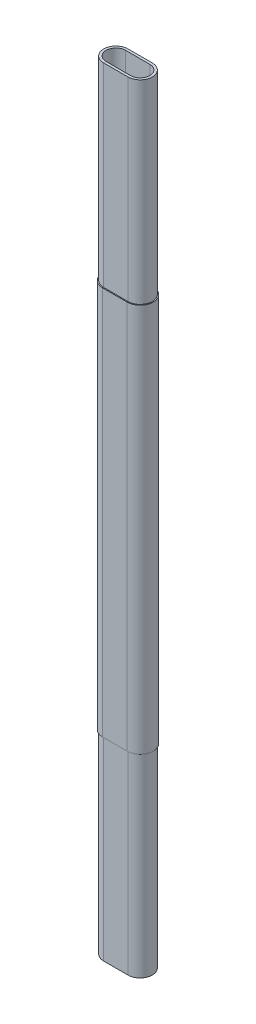
ISO-10303-21;
HEADER;
FILE_DESCRIPTION(('STEP AP214'),'2;1');
FILE_NAME('part.step','',(''),(''),'','','');
FILE_SCHEMA(('AUTOMOTIVE_DESIGN { 1 0 10303 214 1 1 1 1 }'));
ENDSEC;
DATA;
#1=APPLICATION_CONTEXT('core data for automotive mechanical design processes');
#2=APPLICATION_PROTOCOL_DEFINITION('international standard','automotive_design',2000,#1);
#3=PRODUCT_CONTEXT('',#1,'mechanical');
#4=PRODUCT('Part','Part','',(#3));
#5=PRODUCT_RELATED_PRODUCT_CATEGORY('part','',(#4));
#6=PRODUCT_DEFINITION_FORMATION('','',#4);
#7=PRODUCT_DEFINITION_CONTEXT('part definition',#1,'design');
#8=PRODUCT_DEFINITION('design','',#6,#7);
#9=PRODUCT_DEFINITION_SHAPE('','',#8);
#10=(LENGTH_UNIT() NAMED_UNIT(*) SI_UNIT(.MILLI.,.METRE.));
#11=(NAMED_UNIT(*) PLANE_ANGLE_UNIT() SI_UNIT($,.RADIAN.));
#12=(NAMED_UNIT(*) SI_UNIT($,.STERADIAN.) SOLID_ANGLE_UNIT());
#13=UNCERTAINTY_MEASURE_WITH_UNIT(LENGTH_MEASURE(1.E-05),#10,'distance_accuracy_value','');
#14=(GEOMETRIC_REPRESENTATION_CONTEXT(3) GLOBAL_UNCERTAINTY_ASSIGNED_CONTEXT((#13)) GLOBAL_UNIT_ASSIGNED_CONTEXT((#10,
#11,#12)) REPRESENTATION_CONTEXT('',''));
#15=CARTESIAN_POINT('',(0.,0.,0.));
#16=DIRECTION('',(0.,0.,1.));
#17=DIRECTION('',(1.,0.,0.));
#18=AXIS2_PLACEMENT_3D('',#15,#16,#17);
#19=CARTESIAN_POINT('',(-0.25,-8.,0.));
#20=DIRECTION('',(0.,1.,0.));
#21=DIRECTION('',(0.,0.,1.));
#22=AXIS2_PLACEMENT_3D('',#19,#20,#21);
#23=CYLINDRICAL_SURFACE('',#22,0.25);
#24=DIRECTION('',(0.,1.,0.));
#25=VECTOR('',#24,1.);
#26=CARTESIAN_POINT('',(-0.25,-8.,0.25));
#27=LINE('',#26,#25);
#28=CARTESIAN_POINT('',(-0.25,-8.,0.25));
#29=VERTEX_POINT('',#28);
#30=CARTESIAN_POINT('',(-0.25,-4.,0.25));
#31=VERTEX_POINT('',#30);
#32=EDGE_CURVE('E134',#29,#31,#27,.T.);
#33=ORIENTED_EDGE('',*,*,#32,.T.);
#34=CARTESIAN_POINT('',(-0.25,-4.,0.));
#35=DIRECTION('',(0.,1.,0.));
#36=DIRECTION('',(0.,0.,1.));
#37=AXIS2_PLACEMENT_3D('',#34,#35,#36);
#38=CIRCLE('',#37,0.25);
#39=CARTESIAN_POINT('',(-0.25,-4.,-0.25));
#40=VERTEX_POINT('',#39);
#41=EDGE_CURVE('E277',#40,#31,#38,.T.);
#42=ORIENTED_EDGE('',*,*,#41,.F.);
#43=DIRECTION('',(0.,1.,0.));
#44=VECTOR('',#43,1.);
#45=CARTESIAN_POINT('',(-0.25,-8.,-0.25));
#46=LINE('',#45,#44);
#47=CARTESIAN_POINT('',(-0.25,-8.,-0.25));
#48=VERTEX_POINT('',#47);
#49=EDGE_CURVE('E12',#48,#40,#46,.T.);
#50=ORIENTED_EDGE('',*,*,#49,.F.);
#51=CARTESIAN_POINT('',(-0.25,-8.,0.));
#52=DIRECTION('',(0.,1.,0.));
#53=DIRECTION('',(0.,0.,1.));
#54=AXIS2_PLACEMENT_3D('',#51,#52,#53);
#55=CIRCLE('',#54,0.25);
#56=EDGE_CURVE('E341',#48,#29,#55,.T.);
#57=ORIENTED_EDGE('',*,*,#56,.T.);
#58=EDGE_LOOP('',(#33,#42,#50,#57));
#59=FACE_BOUND('',#58,.T.);
#60=ADVANCED_FACE('F130',(#59),#23,.T.);
#61=CARTESIAN_POINT('',(-0.25,-8.,-0.25));
#62=DIRECTION('',(0.,0.,-1.));
#63=DIRECTION('',(-1.,0.,0.));
#64=AXIS2_PLACEMENT_3D('',#61,#62,#63);
#65=PLANE('',#64);
#66=ORIENTED_EDGE('',*,*,#49,.T.);
#67=DIRECTION('',(-1.,0.,0.));
#68=VECTOR('',#67,1.);
#69=CARTESIAN_POINT('',(-0.25,-4.,-0.25));
#70=LINE('',#69,#68);
#71=CARTESIAN_POINT('',(0.25,-4.,-0.25));
#72=VERTEX_POINT('',#71);
#73=EDGE_CURVE('E283',#72,#40,#70,.T.);
#74=ORIENTED_EDGE('',*,*,#73,.F.);
#75=DIRECTION('',(0.,1.,0.));
#76=VECTOR('',#75,1.);
#77=CARTESIAN_POINT('',(0.25,-8.,-0.25));
#78=LINE('',#77,#76);
#79=CARTESIAN_POINT('',(0.25,-8.,-0.25));
#80=VERTEX_POINT('',#79);
#81=EDGE_CURVE('E357',#80,#72,#78,.T.);
#82=ORIENTED_EDGE('',*,*,#81,.F.);
#83=DIRECTION('',(-1.,0.,0.));
#84=VECTOR('',#83,1.);
#85=CARTESIAN_POINT('',(-0.25,-8.,-0.25));
#86=LINE('',#85,#84);
#87=EDGE_CURVE('E255',#80,#48,#86,.T.);
#88=ORIENTED_EDGE('',*,*,#87,.T.);
#89=EDGE_LOOP('',(#66,#74,#82,#88));
#90=FACE_BOUND('',#89,.T.);
#91=ADVANCED_FACE('F383',(#90),#65,.T.);
#92=CARTESIAN_POINT('',(0.25,-8.,0.));
#93=DIRECTION('',(0.,1.,0.));
#94=DIRECTION('',(0.,0.,1.));
#95=AXIS2_PLACEMENT_3D('',#92,#93,#94);
#96=CYLINDRICAL_SURFACE('',#95,0.25);
#97=ORIENTED_EDGE('',*,*,#81,.T.);
#98=CARTESIAN_POINT('',(0.25,-4.,0.));
#99=DIRECTION('',(0.,1.,0.));
#100=DIRECTION('',(0.,0.,1.));
#101=AXIS2_PLACEMENT_3D('',#98,#99,#100);
#102=CIRCLE('',#101,0.25);
#103=CARTESIAN_POINT('',(0.25,-4.,0.25));
#104=VERTEX_POINT('',#103);
#105=EDGE_CURVE('E281',#104,#72,#102,.T.);
#106=ORIENTED_EDGE('',*,*,#105,.F.);
#107=DIRECTION('',(0.,1.,0.));
#108=VECTOR('',#107,1.);
#109=CARTESIAN_POINT('',(0.25,-8.,0.25));
#110=LINE('',#109,#108);
#111=CARTESIAN_POINT('',(0.25,-8.,0.25));
#112=VERTEX_POINT('',#111);
#113=EDGE_CURVE('E360',#112,#104,#110,.T.);
#114=ORIENTED_EDGE('',*,*,#113,.F.);
#115=CARTESIAN_POINT('',(0.25,-8.,0.));
#116=DIRECTION('',(0.,1.,0.));
#117=DIRECTION('',(0.,0.,1.));
#118=AXIS2_PLACEMENT_3D('',#115,#116,#117);
#119=CIRCLE('',#118,0.25);
#120=EDGE_CURVE('E352',#112,#80,#119,.T.);
#121=ORIENTED_EDGE('',*,*,#120,.T.);
#122=EDGE_LOOP('',(#97,#106,#114,#121));
#123=FACE_BOUND('',#122,.T.);
#124=ADVANCED_FACE('F376',(#123),#96,.T.);
#125=CARTESIAN_POINT('',(0.25,-8.,0.25));
#126=DIRECTION('',(0.,0.,1.));
#127=DIRECTION('',(1.,0.,0.));
#128=AXIS2_PLACEMENT_3D('',#125,#126,#127);
#129=PLANE('',#128);
#130=ORIENTED_EDGE('',*,*,#113,.T.);
#131=DIRECTION('',(1.,0.,0.));
#132=VECTOR('',#131,1.);
#133=CARTESIAN_POINT('',(-0.25,-4.,0.25));
#134=LINE('',#133,#132);
#135=EDGE_CURVE('E279',#31,#104,#134,.T.);
#136=ORIENTED_EDGE('',*,*,#135,.F.);
#137=ORIENTED_EDGE('',*,*,#32,.F.);
#138=DIRECTION('',(1.,0.,0.));
#139=VECTOR('',#138,1.);
#140=CARTESIAN_POINT('',(0.25,-8.,0.25));
#141=LINE('',#140,#139);
#142=EDGE_CURVE('E349',#29,#112,#141,.T.);
#143=ORIENTED_EDGE('',*,*,#142,.T.);
#144=EDGE_LOOP('',(#130,#136,#137,#143));
#145=FACE_BOUND('',#144,.T.);
#146=ADVANCED_FACE('F370',(#145),#129,.T.);
#147=CARTESIAN_POINT('',(-0.25,4.,0.));
#148=DIRECTION('',(0.,1.,0.));
#149=DIRECTION('',(0.,0.,1.));
#150=AXIS2_PLACEMENT_3D('',#147,#148,#149);
#151=CIRCLE('',#150,0.25);
#152=CARTESIAN_POINT('',(-0.25,4.,-0.25));
#153=VERTEX_POINT('',#152);
#154=CARTESIAN_POINT('',(-0.25,4.,0.25));
#155=VERTEX_POINT('',#154);
#156=EDGE_CURVE('E257',#153,#155,#151,.T.);
#157=ORIENTED_EDGE('',*,*,#156,.T.);
#158=CARTESIAN_POINT('',(-0.25,8.,0.25));
#159=VERTEX_POINT('',#158);
#160=EDGE_CURVE('E245',#155,#159,#27,.T.);
#161=ORIENTED_EDGE('',*,*,#160,.T.);
#162=CARTESIAN_POINT('',(-0.25,8.,0.));
#163=DIRECTION('',(0.,1.,0.));
#164=DIRECTION('',(0.,0.,1.));
#165=AXIS2_PLACEMENT_3D('',#162,#163,#164);
#166=CIRCLE('',#165,0.25);
#167=CARTESIAN_POINT('',(-0.25,8.,-0.25));
#168=VERTEX_POINT('',#167);
#169=EDGE_CURVE('E317',#168,#159,#166,.T.);
#170=ORIENTED_EDGE('',*,*,#169,.F.);
#171=EDGE_CURVE('E139',#153,#168,#46,.T.);
#172=ORIENTED_EDGE('',*,*,#171,.F.);
#173=EDGE_LOOP('',(#157,#161,#170,#172));
#174=FACE_BOUND('',#173,.T.);
#175=ADVANCED_FACE('F132',(#174),#23,.T.);
#176=DIRECTION('',(-1.,0.,0.));
#177=VECTOR('',#176,1.);
#178=CARTESIAN_POINT('',(-0.25,4.,-0.25));
#179=LINE('',#178,#177);
#180=CARTESIAN_POINT('',(0.25,4.,-0.25));
#181=VERTEX_POINT('',#180);
#182=EDGE_CURVE('E147',#181,#153,#179,.T.);
#183=ORIENTED_EDGE('',*,*,#182,.T.);
#184=ORIENTED_EDGE('',*,*,#171,.T.);
#185=DIRECTION('',(-1.,0.,0.));
#186=VECTOR('',#185,1.);
#187=CARTESIAN_POINT('',(-0.25,8.,-0.25));
#188=LINE('',#187,#186);
#189=CARTESIAN_POINT('',(0.25,8.,-0.25));
#190=VERTEX_POINT('',#189);
#191=EDGE_CURVE('E323',#190,#168,#188,.T.);
#192=ORIENTED_EDGE('',*,*,#191,.F.);
#193=EDGE_CURVE('E359',#181,#190,#78,.T.);
#194=ORIENTED_EDGE('',*,*,#193,.F.);
#195=EDGE_LOOP('',(#183,#184,#192,#194));
#196=FACE_BOUND('',#195,.T.);
#197=ADVANCED_FACE('F386',(#196),#65,.T.);
#198=CARTESIAN_POINT('',(0.25,4.,0.));
#199=DIRECTION('',(0.,1.,0.));
#200=DIRECTION('',(0.,0.,1.));
#201=AXIS2_PLACEMENT_3D('',#198,#199,#200);
#202=CIRCLE('',#201,0.25);
#203=CARTESIAN_POINT('',(0.25,4.,0.25));
#204=VERTEX_POINT('',#203);
#205=EDGE_CURVE('E155',#204,#181,#202,.T.);
#206=ORIENTED_EDGE('',*,*,#205,.T.);
#207=ORIENTED_EDGE('',*,*,#193,.T.);
#208=CARTESIAN_POINT('',(0.25,8.,0.));
#209=DIRECTION('',(0.,1.,0.));
#210=DIRECTION('',(0.,0.,1.));
#211=AXIS2_PLACEMENT_3D('',#208,#209,#210);
#212=CIRCLE('',#211,0.25);
#213=CARTESIAN_POINT('',(0.25,8.,0.25));
#214=VERTEX_POINT('',#213);
#215=EDGE_CURVE('E320',#214,#190,#212,.T.);
#216=ORIENTED_EDGE('',*,*,#215,.F.);
#217=EDGE_CURVE('E362',#204,#214,#110,.T.);
#218=ORIENTED_EDGE('',*,*,#217,.F.);
#219=EDGE_LOOP('',(#206,#207,#216,#218));
#220=FACE_BOUND('',#219,.T.);
#221=ADVANCED_FACE('F392',(#220),#96,.T.);
#222=DIRECTION('',(1.,0.,0.));
#223=VECTOR('',#222,1.);
#224=CARTESIAN_POINT('',(-0.25,4.,0.25));
#225=LINE('',#224,#223);
#226=EDGE_CURVE('E249',#155,#204,#225,.T.);
#227=ORIENTED_EDGE('',*,*,#226,.T.);
#228=ORIENTED_EDGE('',*,*,#217,.T.);
#229=DIRECTION('',(1.,0.,0.));
#230=VECTOR('',#229,1.);
#231=CARTESIAN_POINT('',(0.25,8.,0.25));
#232=LINE('',#231,#230);
#233=EDGE_CURVE('E251',#159,#214,#232,.T.);
#234=ORIENTED_EDGE('',*,*,#233,.F.);
#235=ORIENTED_EDGE('',*,*,#160,.F.);
#236=EDGE_LOOP('',(#227,#228,#234,#235));
#237=FACE_BOUND('',#236,.T.);
#238=ADVANCED_FACE('F247',(#237),#129,.T.);
#239=CARTESIAN_POINT('',(-0.25,-8.,0.));
#240=DIRECTION('',(0.,1.,0.));
#241=DIRECTION('',(0.,0.,1.));
#242=AXIS2_PLACEMENT_3D('',#239,#240,#241);
#243=PLANE('',#242);
#244=DIRECTION('',(-1.,0.,0.));
#245=VECTOR('',#244,1.);
#246=CARTESIAN_POINT('',(-0.25,-8.,-0.2));
#247=LINE('',#246,#245);
#248=CARTESIAN_POINT('',(0.25,-8.,-0.2));
#249=VERTEX_POINT('',#248);
#250=CARTESIAN_POINT('',(-0.25,-8.,-0.2));
#251=VERTEX_POINT('',#250);
#252=EDGE_CURVE('E335',#249,#251,#247,.T.);
#253=ORIENTED_EDGE('',*,*,#252,.T.);
#254=CARTESIAN_POINT('',(-0.25,-8.,0.));
#255=DIRECTION('',(0.,1.,0.));
#256=DIRECTION('',(1.,0.,0.));
#257=AXIS2_PLACEMENT_3D('',#254,#255,#256);
#258=CIRCLE('',#257,0.2);
#259=CARTESIAN_POINT('',(-0.25,-8.,0.2));
#260=VERTEX_POINT('',#259);
#261=EDGE_CURVE('E326',#251,#260,#258,.T.);
#262=ORIENTED_EDGE('',*,*,#261,.T.);
#263=DIRECTION('',(1.,0.,0.));
#264=VECTOR('',#263,1.);
#265=CARTESIAN_POINT('',(0.25,-8.,0.2));
#266=LINE('',#265,#264);
#267=CARTESIAN_POINT('',(0.25,-8.,0.2));
#268=VERTEX_POINT('',#267);
#269=EDGE_CURVE('E329',#260,#268,#266,.T.);
#270=ORIENTED_EDGE('',*,*,#269,.T.);
#271=CARTESIAN_POINT('',(0.25,-8.,0.));
#272=DIRECTION('',(0.,1.,0.));
#273=DIRECTION('',(1.,0.,0.));
#274=AXIS2_PLACEMENT_3D('',#271,#272,#273);
#275=CIRCLE('',#274,0.2);
#276=EDGE_CURVE('E332',#268,#249,#275,.T.);
#277=ORIENTED_EDGE('',*,*,#276,.T.);
#278=EDGE_LOOP('',(#253,#262,#270,#277));
#279=FACE_BOUND('',#278,.T.);
#280=ORIENTED_EDGE('',*,*,#56,.F.);
#281=ORIENTED_EDGE('',*,*,#87,.F.);
#282=ORIENTED_EDGE('',*,*,#120,.F.);
#283=ORIENTED_EDGE('',*,*,#142,.F.);
#284=EDGE_LOOP('',(#280,#281,#282,#283));
#285=FACE_BOUND('',#284,.T.);
#286=ADVANCED_FACE('F373',(#279,#285),#243,.F.);
#287=CARTESIAN_POINT('',(-0.25,-8.,0.));
#288=DIRECTION('',(0.,1.,0.));
#289=DIRECTION('',(0.,0.,1.));
#290=AXIS2_PLACEMENT_3D('',#287,#288,#289);
#291=CYLINDRICAL_SURFACE('',#290,0.2);
#292=DIRECTION('',(0.,1.,0.));
#293=VECTOR('',#292,1.);
#294=CARTESIAN_POINT('',(-0.25,-8.,-0.2));
#295=LINE('',#294,#293);
#296=CARTESIAN_POINT('',(-0.25,8.,-0.2));
#297=VERTEX_POINT('',#296);
#298=EDGE_CURVE('E339',#251,#297,#295,.T.);
#299=ORIENTED_EDGE('',*,*,#298,.T.);
#300=CARTESIAN_POINT('',(-0.25,8.,0.));
#301=DIRECTION('',(0.,1.,0.));
#302=DIRECTION('',(1.,0.,0.));
#303=AXIS2_PLACEMENT_3D('',#300,#301,#302);
#304=CIRCLE('',#303,0.2);
#305=CARTESIAN_POINT('',(-0.25,8.,0.2));
#306=VERTEX_POINT('',#305);
#307=EDGE_CURVE('E300',#297,#306,#304,.T.);
#308=ORIENTED_EDGE('',*,*,#307,.T.);
#309=DIRECTION('',(0.,1.,0.));
#310=VECTOR('',#309,1.);
#311=CARTESIAN_POINT('',(-0.25,-8.,0.2));
#312=LINE('',#311,#310);
#313=EDGE_CURVE('E338',#260,#306,#312,.T.);
#314=ORIENTED_EDGE('',*,*,#313,.F.);
#315=ORIENTED_EDGE('',*,*,#261,.F.);
#316=EDGE_LOOP('',(#299,#308,#314,#315));
#317=FACE_BOUND('',#316,.T.);
#318=ADVANCED_FACE('F408',(#317),#291,.F.);
#319=CARTESIAN_POINT('',(-0.25,-8.,-0.2));
#320=DIRECTION('',(0.,0.,-1.));
#321=DIRECTION('',(-1.,0.,0.));
#322=AXIS2_PLACEMENT_3D('',#319,#320,#321);
#323=PLANE('',#322);
#324=DIRECTION('',(0.,1.,0.));
#325=VECTOR('',#324,1.);
#326=CARTESIAN_POINT('',(0.25,-8.,-0.2));
#327=LINE('',#326,#325);
#328=CARTESIAN_POINT('',(0.25,8.,-0.2));
#329=VERTEX_POINT('',#328);
#330=EDGE_CURVE('E342',#249,#329,#327,.T.);
#331=ORIENTED_EDGE('',*,*,#330,.T.);
#332=DIRECTION('',(-1.,0.,0.));
#333=VECTOR('',#332,1.);
#334=CARTESIAN_POINT('',(-0.25,8.,-0.2));
#335=LINE('',#334,#333);
#336=EDGE_CURVE('E314',#329,#297,#335,.T.);
#337=ORIENTED_EDGE('',*,*,#336,.T.);
#338=ORIENTED_EDGE('',*,*,#298,.F.);
#339=ORIENTED_EDGE('',*,*,#252,.F.);
#340=EDGE_LOOP('',(#331,#337,#338,#339));
#341=FACE_BOUND('',#340,.T.);
#342=ADVANCED_FACE('F413',(#341),#323,.F.);
#343=CARTESIAN_POINT('',(0.25,-8.,0.));
#344=DIRECTION('',(0.,1.,0.));
#345=DIRECTION('',(0.,0.,1.));
#346=AXIS2_PLACEMENT_3D('',#343,#344,#345);
#347=CYLINDRICAL_SURFACE('',#346,0.2);
#348=DIRECTION('',(0.,1.,0.));
#349=VECTOR('',#348,1.);
#350=CARTESIAN_POINT('',(0.25,-8.,0.2));
#351=LINE('',#350,#349);
#352=CARTESIAN_POINT('',(0.25,8.,0.2));
#353=VERTEX_POINT('',#352);
#354=EDGE_CURVE('E344',#268,#353,#351,.T.);
#355=ORIENTED_EDGE('',*,*,#354,.T.);
#356=CARTESIAN_POINT('',(0.25,8.,0.));
#357=DIRECTION('',(0.,1.,0.));
#358=DIRECTION('',(1.,0.,0.));
#359=AXIS2_PLACEMENT_3D('',#356,#357,#358);
#360=CIRCLE('',#359,0.2);
#361=EDGE_CURVE('E311',#353,#329,#360,.T.);
#362=ORIENTED_EDGE('',*,*,#361,.T.);
#363=ORIENTED_EDGE('',*,*,#330,.F.);
#364=ORIENTED_EDGE('',*,*,#276,.F.);
#365=EDGE_LOOP('',(#355,#362,#363,#364));
#366=FACE_BOUND('',#365,.T.);
#367=ADVANCED_FACE('F421',(#366),#347,.F.);
#368=CARTESIAN_POINT('',(0.25,-8.,0.2));
#369=DIRECTION('',(0.,0.,1.));
#370=DIRECTION('',(1.,0.,0.));
#371=AXIS2_PLACEMENT_3D('',#368,#369,#370);
#372=PLANE('',#371);
#373=ORIENTED_EDGE('',*,*,#313,.T.);
#374=DIRECTION('',(1.,0.,0.));
#375=VECTOR('',#374,1.);
#376=CARTESIAN_POINT('',(0.25,8.,0.2));
#377=LINE('',#376,#375);
#378=EDGE_CURVE('E308',#306,#353,#377,.T.);
#379=ORIENTED_EDGE('',*,*,#378,.T.);
#380=ORIENTED_EDGE('',*,*,#354,.F.);
#381=ORIENTED_EDGE('',*,*,#269,.F.);
#382=EDGE_LOOP('',(#373,#379,#380,#381));
#383=FACE_BOUND('',#382,.T.);
#384=ADVANCED_FACE('F417',(#383),#372,.F.);
#385=CARTESIAN_POINT('',(-0.25,8.,0.));
#386=DIRECTION('',(0.,1.,0.));
#387=DIRECTION('',(0.,0.,1.));
#388=AXIS2_PLACEMENT_3D('',#385,#386,#387);
#389=PLANE('',#388);
#390=ORIENTED_EDGE('',*,*,#169,.T.);
#391=ORIENTED_EDGE('',*,*,#233,.T.);
#392=ORIENTED_EDGE('',*,*,#215,.T.);
#393=ORIENTED_EDGE('',*,*,#191,.T.);
#394=EDGE_LOOP('',(#390,#391,#392,#393));
#395=FACE_BOUND('',#394,.T.);
#396=ORIENTED_EDGE('',*,*,#378,.F.);
#397=ORIENTED_EDGE('',*,*,#307,.F.);
#398=ORIENTED_EDGE('',*,*,#336,.F.);
#399=ORIENTED_EDGE('',*,*,#361,.F.);
#400=EDGE_LOOP('',(#396,#397,#398,#399));
#401=FACE_BOUND('',#400,.T.);
#402=ADVANCED_FACE('F420',(#395,#401),#389,.T.);
#403=CARTESIAN_POINT('',(-0.25,-4.,0.));
#404=DIRECTION('',(0.,1.,0.));
#405=DIRECTION('',(0.,0.,1.));
#406=AXIS2_PLACEMENT_3D('',#403,#404,#405);
#407=CYLINDRICAL_SURFACE('',#406,0.27);
#408=DIRECTION('',(0.,1.,0.));
#409=VECTOR('',#408,1.);
#410=CARTESIAN_POINT('',(-0.25,-4.,0.27));
#411=LINE('',#410,#409);
#412=CARTESIAN_POINT('',(-0.25,-4.,0.27));
#413=VERTEX_POINT('',#412);
#414=CARTESIAN_POINT('',(-0.25,4.,0.27));
#415=VERTEX_POINT('',#414);
#416=EDGE_CURVE('E297',#413,#415,#411,.T.);
#417=ORIENTED_EDGE('',*,*,#416,.T.);
#418=CARTESIAN_POINT('',(-0.25,4.,0.));
#419=DIRECTION('',(0.,1.,0.));
#420=DIRECTION('',(-1.,0.,0.));
#421=AXIS2_PLACEMENT_3D('',#418,#419,#420);
#422=CIRCLE('',#421,0.27);
#423=CARTESIAN_POINT('',(-0.25,4.,-0.27));
#424=VERTEX_POINT('',#423);
#425=EDGE_CURVE('E265',#424,#415,#422,.T.);
#426=ORIENTED_EDGE('',*,*,#425,.F.);
#427=DIRECTION('',(0.,1.,0.));
#428=VECTOR('',#427,1.);
#429=CARTESIAN_POINT('',(-0.25,-4.,-0.27));
#430=LINE('',#429,#428);
#431=CARTESIAN_POINT('',(-0.25,-4.,-0.27));
#432=VERTEX_POINT('',#431);
#433=EDGE_CURVE('E298',#432,#424,#430,.T.);
#434=ORIENTED_EDGE('',*,*,#433,.F.);
#435=CARTESIAN_POINT('',(-0.25,-4.,0.));
#436=DIRECTION('',(0.,1.,0.));
#437=DIRECTION('',(-1.,0.,0.));
#438=AXIS2_PLACEMENT_3D('',#435,#436,#437);
#439=CIRCLE('',#438,0.27);
#440=EDGE_CURVE('E285',#432,#413,#439,.T.);
#441=ORIENTED_EDGE('',*,*,#440,.T.);
#442=EDGE_LOOP('',(#417,#426,#434,#441));
#443=FACE_BOUND('',#442,.T.);
#444=ADVANCED_FACE('F431',(#443),#407,.T.);
#445=CARTESIAN_POINT('',(-0.25,-4.,-0.27));
#446=DIRECTION('',(0.,0.,-1.));
#447=DIRECTION('',(-1.,0.,0.));
#448=AXIS2_PLACEMENT_3D('',#445,#446,#447);
#449=PLANE('',#448);
#450=ORIENTED_EDGE('',*,*,#433,.T.);
#451=DIRECTION('',(-1.,0.,0.));
#452=VECTOR('',#451,1.);
#453=CARTESIAN_POINT('',(-0.25,4.,-0.27));
#454=LINE('',#453,#452);
#455=CARTESIAN_POINT('',(0.25,4.,-0.27));
#456=VERTEX_POINT('',#455);
#457=EDGE_CURVE('E274',#456,#424,#454,.T.);
#458=ORIENTED_EDGE('',*,*,#457,.F.);
#459=DIRECTION('',(0.,1.,0.));
#460=VECTOR('',#459,1.);
#461=CARTESIAN_POINT('',(0.25,-4.,-0.27));
#462=LINE('',#461,#460);
#463=CARTESIAN_POINT('',(0.25,-4.,-0.27));
#464=VERTEX_POINT('',#463);
#465=EDGE_CURVE('E301',#464,#456,#462,.T.);
#466=ORIENTED_EDGE('',*,*,#465,.F.);
#467=DIRECTION('',(-1.,0.,0.));
#468=VECTOR('',#467,1.);
#469=CARTESIAN_POINT('',(-0.25,-4.,-0.27));
#470=LINE('',#469,#468);
#471=EDGE_CURVE('E294',#464,#432,#470,.T.);
#472=ORIENTED_EDGE('',*,*,#471,.T.);
#473=EDGE_LOOP('',(#450,#458,#466,#472));
#474=FACE_BOUND('',#473,.T.);
#475=ADVANCED_FACE('F435',(#474),#449,.T.);
#476=CARTESIAN_POINT('',(0.25,-4.,0.));
#477=DIRECTION('',(0.,1.,0.));
#478=DIRECTION('',(0.,0.,1.));
#479=AXIS2_PLACEMENT_3D('',#476,#477,#478);
#480=CYLINDRICAL_SURFACE('',#479,0.27);
#481=ORIENTED_EDGE('',*,*,#465,.T.);
#482=CARTESIAN_POINT('',(0.25,4.,0.));
#483=DIRECTION('',(0.,1.,0.));
#484=DIRECTION('',(-1.,0.,0.));
#485=AXIS2_PLACEMENT_3D('',#482,#483,#484);
#486=CIRCLE('',#485,0.27);
#487=CARTESIAN_POINT('',(0.25,4.,0.27));
#488=VERTEX_POINT('',#487);
#489=EDGE_CURVE('E271',#488,#456,#486,.T.);
#490=ORIENTED_EDGE('',*,*,#489,.F.);
#491=DIRECTION('',(0.,1.,0.));
#492=VECTOR('',#491,1.);
#493=CARTESIAN_POINT('',(0.25,-4.,0.27));
#494=LINE('',#493,#492);
#495=CARTESIAN_POINT('',(0.25,-4.,0.27));
#496=VERTEX_POINT('',#495);
#497=EDGE_CURVE('E303',#496,#488,#494,.T.);
#498=ORIENTED_EDGE('',*,*,#497,.F.);
#499=CARTESIAN_POINT('',(0.25,-4.,0.));
#500=DIRECTION('',(0.,1.,0.));
#501=DIRECTION('',(-1.,0.,0.));
#502=AXIS2_PLACEMENT_3D('',#499,#500,#501);
#503=CIRCLE('',#502,0.27);
#504=EDGE_CURVE('E291',#496,#464,#503,.T.);
#505=ORIENTED_EDGE('',*,*,#504,.T.);
#506=EDGE_LOOP('',(#481,#490,#498,#505));
#507=FACE_BOUND('',#506,.T.);
#508=ADVANCED_FACE('F440',(#507),#480,.T.);
#509=CARTESIAN_POINT('',(-0.25,-4.,0.27));
#510=DIRECTION('',(0.,0.,1.));
#511=DIRECTION('',(1.,0.,0.));
#512=AXIS2_PLACEMENT_3D('',#509,#510,#511);
#513=PLANE('',#512);
#514=ORIENTED_EDGE('',*,*,#497,.T.);
#515=DIRECTION('',(1.,0.,0.));
#516=VECTOR('',#515,1.);
#517=CARTESIAN_POINT('',(-0.25,4.,0.27));
#518=LINE('',#517,#516);
#519=EDGE_CURVE('E268',#415,#488,#518,.T.);
#520=ORIENTED_EDGE('',*,*,#519,.F.);
#521=ORIENTED_EDGE('',*,*,#416,.F.);
#522=DIRECTION('',(1.,0.,0.));
#523=VECTOR('',#522,1.);
#524=CARTESIAN_POINT('',(-0.25,-4.,0.27));
#525=LINE('',#524,#523);
#526=EDGE_CURVE('E288',#413,#496,#525,.T.);
#527=ORIENTED_EDGE('',*,*,#526,.T.);
#528=EDGE_LOOP('',(#514,#520,#521,#527));
#529=FACE_BOUND('',#528,.T.);
#530=ADVANCED_FACE('F437',(#529),#513,.T.);
#531=CARTESIAN_POINT('',(-0.25,-4.,0.));
#532=DIRECTION('',(0.,1.,0.));
#533=DIRECTION('',(0.,0.,1.));
#534=AXIS2_PLACEMENT_3D('',#531,#532,#533);
#535=PLANE('',#534);
#536=ORIENTED_EDGE('',*,*,#73,.T.);
#537=ORIENTED_EDGE('',*,*,#41,.T.);
#538=ORIENTED_EDGE('',*,*,#135,.T.);
#539=ORIENTED_EDGE('',*,*,#105,.T.);
#540=EDGE_LOOP('',(#536,#537,#538,#539));
#541=FACE_BOUND('',#540,.T.);
#542=ORIENTED_EDGE('',*,*,#440,.F.);
#543=ORIENTED_EDGE('',*,*,#471,.F.);
#544=ORIENTED_EDGE('',*,*,#504,.F.);
#545=ORIENTED_EDGE('',*,*,#526,.F.);
#546=EDGE_LOOP('',(#542,#543,#544,#545));
#547=FACE_BOUND('',#546,.T.);
#548=ADVANCED_FACE('F380',(#541,#547),#535,.F.);
#549=CARTESIAN_POINT('',(-0.25,4.,0.));
#550=DIRECTION('',(0.,1.,0.));
#551=DIRECTION('',(0.,0.,1.));
#552=AXIS2_PLACEMENT_3D('',#549,#550,#551);
#553=PLANE('',#552);
#554=ORIENTED_EDGE('',*,*,#425,.T.);
#555=ORIENTED_EDGE('',*,*,#519,.T.);
#556=ORIENTED_EDGE('',*,*,#489,.T.);
#557=ORIENTED_EDGE('',*,*,#457,.T.);
#558=EDGE_LOOP('',(#554,#555,#556,#557));
#559=FACE_BOUND('',#558,.T.);
#560=ORIENTED_EDGE('',*,*,#226,.F.);
#561=ORIENTED_EDGE('',*,*,#156,.F.);
#562=ORIENTED_EDGE('',*,*,#182,.F.);
#563=ORIENTED_EDGE('',*,*,#205,.F.);
#564=EDGE_LOOP('',(#560,#561,#562,#563));
#565=FACE_BOUND('',#564,.T.);
#566=ADVANCED_FACE('F260',(#559,#565),#553,.T.);
#567=CLOSED_SHELL('',(#60,#91,#124,#146,#175,#197,#221,#238,#286,#318,#342,#367,#384,#402,#444,
#475,#508,#530,#548,#566));
#568=MANIFOLD_SOLID_BREP('B2',#567);
#569=ADVANCED_BREP_SHAPE_REPRESENTATION('',(#18,#568),#14);
#570=SHAPE_DEFINITION_REPRESENTATION(#9,#569);
ENDSEC;
END-ISO-10303-21;
